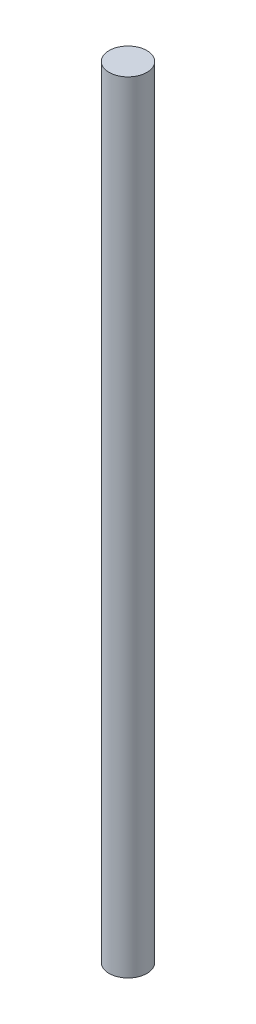
ISO-10303-21;
HEADER;
FILE_DESCRIPTION(('STEP AP214'),'2;1');
FILE_NAME('part.step','',(''),(''),'','','');
FILE_SCHEMA(('AUTOMOTIVE_DESIGN { 1 0 10303 214 1 1 1 1 }'));
ENDSEC;
DATA;
#1=APPLICATION_CONTEXT('core data for automotive mechanical design processes');
#2=APPLICATION_PROTOCOL_DEFINITION('international standard','automotive_design',2000,#1);
#3=PRODUCT_CONTEXT('',#1,'mechanical');
#4=PRODUCT('Part','Part','',(#3));
#5=PRODUCT_RELATED_PRODUCT_CATEGORY('part','',(#4));
#6=PRODUCT_DEFINITION_FORMATION('','',#4);
#7=PRODUCT_DEFINITION_CONTEXT('part definition',#1,'design');
#8=PRODUCT_DEFINITION('design','',#6,#7);
#9=PRODUCT_DEFINITION_SHAPE('','',#8);
#10=(LENGTH_UNIT() NAMED_UNIT(*) SI_UNIT(.MILLI.,.METRE.));
#11=(NAMED_UNIT(*) PLANE_ANGLE_UNIT() SI_UNIT($,.RADIAN.));
#12=(NAMED_UNIT(*) SI_UNIT($,.STERADIAN.) SOLID_ANGLE_UNIT());
#13=UNCERTAINTY_MEASURE_WITH_UNIT(LENGTH_MEASURE(1.E-05),#10,'distance_accuracy_value','');
#14=(GEOMETRIC_REPRESENTATION_CONTEXT(3) GLOBAL_UNCERTAINTY_ASSIGNED_CONTEXT((#13)) GLOBAL_UNIT_ASSIGNED_CONTEXT((#10,
#11,#12)) REPRESENTATION_CONTEXT('',''));
#15=CARTESIAN_POINT('',(0.,0.,0.));
#16=DIRECTION('',(0.,0.,1.));
#17=DIRECTION('',(1.,0.,0.));
#18=AXIS2_PLACEMENT_3D('',#15,#16,#17);
#19=CARTESIAN_POINT('',(0.,165.,0.));
#20=DIRECTION('',(0.,-1.,0.));
#21=DIRECTION('',(0.,0.,-1.));
#22=AXIS2_PLACEMENT_3D('',#19,#20,#21);
#23=CYLINDRICAL_SURFACE('',#22,4.);
#24=CARTESIAN_POINT('',(0.,165.,0.));
#25=DIRECTION('',(0.,1.,0.));
#26=DIRECTION('',(0.,0.,1.));
#27=AXIS2_PLACEMENT_3D('',#24,#25,#26);
#28=CIRCLE('',#27,4.);
#29=CARTESIAN_POINT('',(0.,165.,4.));
#30=VERTEX_POINT('',#29);
#31=EDGE_CURVE('E10',#30,#30,#28,.T.);
#32=ORIENTED_EDGE('',*,*,#31,.F.);
#33=EDGE_LOOP('',(#32));
#34=FACE_BOUND('',#33,.T.);
#35=CARTESIAN_POINT('',(0.,0.,0.));
#36=DIRECTION('',(0.,1.,0.));
#37=DIRECTION('',(0.,0.,1.));
#38=AXIS2_PLACEMENT_3D('',#35,#36,#37);
#39=CIRCLE('',#38,4.);
#40=CARTESIAN_POINT('',(0.,0.,4.));
#41=VERTEX_POINT('',#40);
#42=EDGE_CURVE('E40',#41,#41,#39,.T.);
#43=ORIENTED_EDGE('',*,*,#42,.T.);
#44=EDGE_LOOP('',(#43));
#45=FACE_BOUND('',#44,.T.);
#46=ADVANCED_FACE('F37',(#34,#45),#23,.T.);
#47=CARTESIAN_POINT('',(0.,165.,0.));
#48=DIRECTION('',(0.,1.,0.));
#49=DIRECTION('',(0.,0.,1.));
#50=AXIS2_PLACEMENT_3D('',#47,#48,#49);
#51=PLANE('',#50);
#52=ORIENTED_EDGE('',*,*,#31,.T.);
#53=EDGE_LOOP('',(#52));
#54=FACE_BOUND('',#53,.T.);
#55=ADVANCED_FACE('F54',(#54),#51,.T.);
#56=CARTESIAN_POINT('',(0.,0.,0.));
#57=DIRECTION('',(0.,1.,0.));
#58=DIRECTION('',(0.,0.,1.));
#59=AXIS2_PLACEMENT_3D('',#56,#57,#58);
#60=PLANE('',#59);
#61=ORIENTED_EDGE('',*,*,#42,.F.);
#62=EDGE_LOOP('',(#61));
#63=FACE_BOUND('',#62,.T.);
#64=ADVANCED_FACE('F52',(#63),#60,.F.);
#65=CLOSED_SHELL('',(#46,#55,#64));
#66=MANIFOLD_SOLID_BREP('B2',#65);
#67=ADVANCED_BREP_SHAPE_REPRESENTATION('',(#18,#66),#14);
#68=SHAPE_DEFINITION_REPRESENTATION(#9,#67);
ENDSEC;
END-ISO-10303-21;
